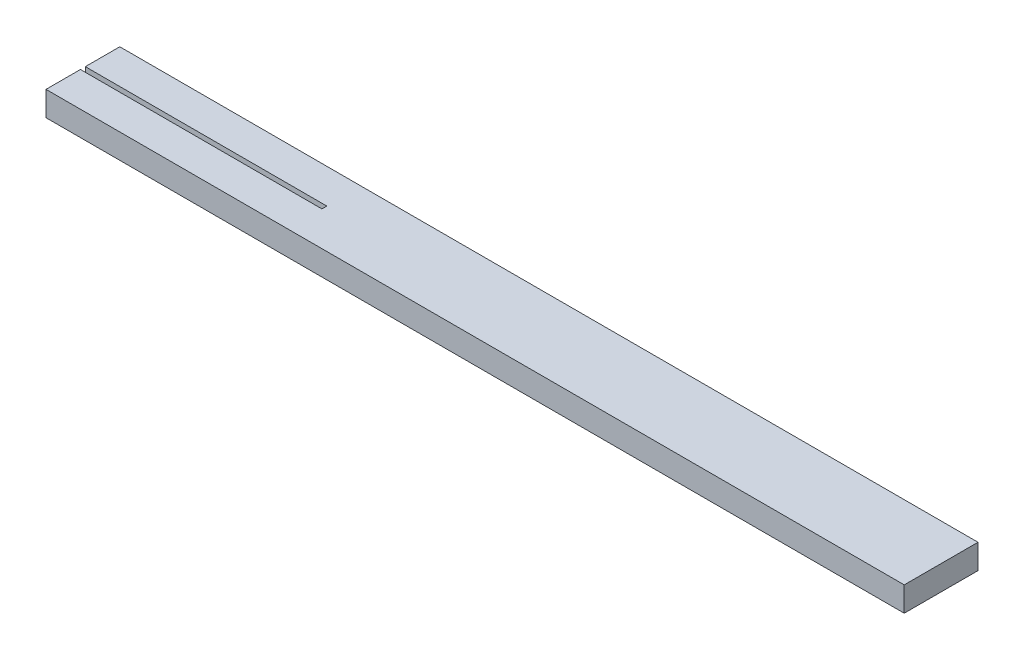
ISO-10303-21;
HEADER;
FILE_DESCRIPTION(('STEP AP214'),'2;1');
FILE_NAME('part.step','',(''),(''),'','','');
FILE_SCHEMA(('AUTOMOTIVE_DESIGN { 1 0 10303 214 1 1 1 1 }'));
ENDSEC;
DATA;
#1=APPLICATION_CONTEXT('core data for automotive mechanical design processes');
#2=APPLICATION_PROTOCOL_DEFINITION('international standard','automotive_design',2000,#1);
#3=PRODUCT_CONTEXT('',#1,'mechanical');
#4=PRODUCT('Part','Part','',(#3));
#5=PRODUCT_RELATED_PRODUCT_CATEGORY('part','',(#4));
#6=PRODUCT_DEFINITION_FORMATION('','',#4);
#7=PRODUCT_DEFINITION_CONTEXT('part definition',#1,'design');
#8=PRODUCT_DEFINITION('design','',#6,#7);
#9=PRODUCT_DEFINITION_SHAPE('','',#8);
#10=(LENGTH_UNIT() NAMED_UNIT(*) SI_UNIT(.MILLI.,.METRE.));
#11=(NAMED_UNIT(*) PLANE_ANGLE_UNIT() SI_UNIT($,.RADIAN.));
#12=(NAMED_UNIT(*) SI_UNIT($,.STERADIAN.) SOLID_ANGLE_UNIT());
#13=UNCERTAINTY_MEASURE_WITH_UNIT(LENGTH_MEASURE(1.E-05),#10,'distance_accuracy_value','');
#14=(GEOMETRIC_REPRESENTATION_CONTEXT(3) GLOBAL_UNCERTAINTY_ASSIGNED_CONTEXT((#13)) GLOBAL_UNIT_ASSIGNED_CONTEXT((#10,
#11,#12)) REPRESENTATION_CONTEXT('',''));
#15=CARTESIAN_POINT('',(0.,0.,0.));
#16=DIRECTION('',(0.,0.,1.));
#17=DIRECTION('',(1.,0.,0.));
#18=AXIS2_PLACEMENT_3D('',#15,#16,#17);
#19=CARTESIAN_POINT('',(-17.0392132961798,0.,-5.81303656597775));
#20=DIRECTION('',(0.,0.,1.));
#21=DIRECTION('',(1.,0.,0.));
#22=AXIS2_PLACEMENT_3D('',#19,#20,#21);
#23=PLANE('',#22);
#24=DIRECTION('',(1.,0.,0.));
#25=VECTOR('',#24,1.);
#26=CARTESIAN_POINT('',(-17.0392132961798,1.,-5.81303656597775));
#27=LINE('',#26,#25);
#28=CARTESIAN_POINT('',(-17.0392132961798,1.,-5.81303656597775));
#29=VERTEX_POINT('',#28);
#30=CARTESIAN_POINT('',(-7.21921329617973,1.,-5.81303656597775));
#31=VERTEX_POINT('',#30);
#32=EDGE_CURVE('E137',#29,#31,#27,.T.);
#33=ORIENTED_EDGE('',*,*,#32,.F.);
#34=DIRECTION('',(0.,1.,0.));
#35=VECTOR('',#34,1.);
#36=CARTESIAN_POINT('',(-17.0392132961798,0.,-5.81303656597775));
#37=LINE('',#36,#35);
#38=CARTESIAN_POINT('',(-17.0392132961798,0.,-5.81303656597775));
#39=VERTEX_POINT('',#38);
#40=EDGE_CURVE('E11',#39,#29,#37,.T.);
#41=ORIENTED_EDGE('',*,*,#40,.F.);
#42=DIRECTION('',(1.,0.,0.));
#43=VECTOR('',#42,1.);
#44=CARTESIAN_POINT('',(-17.0392132961798,0.,-5.81303656597775));
#45=LINE('',#44,#43);
#46=CARTESIAN_POINT('',(-7.21921329617973,0.,-5.81303656597775));
#47=VERTEX_POINT('',#46);
#48=EDGE_CURVE('E157',#39,#47,#45,.T.);
#49=ORIENTED_EDGE('',*,*,#48,.T.);
#50=DIRECTION('',(0.,1.,0.));
#51=VECTOR('',#50,1.);
#52=CARTESIAN_POINT('',(-7.21921329617973,0.,-5.81303656597775));
#53=LINE('',#52,#51);
#54=EDGE_CURVE('E43',#47,#31,#53,.T.);
#55=ORIENTED_EDGE('',*,*,#54,.T.);
#56=EDGE_LOOP('',(#33,#41,#49,#55));
#57=FACE_BOUND('',#56,.T.);
#58=ADVANCED_FACE('F40',(#57),#23,.T.);
#59=CARTESIAN_POINT('',(-17.0392132961798,0.,-7.21303656597775));
#60=DIRECTION('',(-1.,0.,0.));
#61=DIRECTION('',(0.,0.,1.));
#62=AXIS2_PLACEMENT_3D('',#59,#60,#61);
#63=PLANE('',#62);
#64=DIRECTION('',(0.,0.,1.));
#65=VECTOR('',#64,1.);
#66=CARTESIAN_POINT('',(-17.0392132961798,1.,-7.21303656597775));
#67=LINE('',#66,#65);
#68=CARTESIAN_POINT('',(-17.0392132961798,1.,-7.21303656597775));
#69=VERTEX_POINT('',#68);
#70=EDGE_CURVE('E155',#69,#29,#67,.T.);
#71=ORIENTED_EDGE('',*,*,#70,.F.);
#72=DIRECTION('',(0.,1.,0.));
#73=VECTOR('',#72,1.);
#74=CARTESIAN_POINT('',(-17.0392132961798,0.,-7.21303656597775));
#75=LINE('',#74,#73);
#76=CARTESIAN_POINT('',(-17.0392132961798,0.,-7.21303656597775));
#77=VERTEX_POINT('',#76);
#78=EDGE_CURVE('E49',#77,#69,#75,.T.);
#79=ORIENTED_EDGE('',*,*,#78,.F.);
#80=DIRECTION('',(0.,0.,1.));
#81=VECTOR('',#80,1.);
#82=CARTESIAN_POINT('',(-17.0392132961798,0.,-7.21303656597775));
#83=LINE('',#82,#81);
#84=EDGE_CURVE('E126',#77,#39,#83,.T.);
#85=ORIENTED_EDGE('',*,*,#84,.T.);
#86=ORIENTED_EDGE('',*,*,#40,.T.);
#87=EDGE_LOOP('',(#71,#79,#85,#86));
#88=FACE_BOUND('',#87,.T.);
#89=ADVANCED_FACE('F170',(#88),#63,.T.);
#90=CARTESIAN_POINT('',(-5.08921329617973,0.,-7.21303656597775));
#91=DIRECTION('',(0.,0.,-1.));
#92=DIRECTION('',(-1.,0.,0.));
#93=AXIS2_PLACEMENT_3D('',#90,#91,#92);
#94=PLANE('',#93);
#95=DIRECTION('',(-1.,0.,0.));
#96=VECTOR('',#95,1.);
#97=CARTESIAN_POINT('',(-5.08921329617973,1.,-7.21303656597775));
#98=LINE('',#97,#96);
#99=CARTESIAN_POINT('',(17.8607867038202,1.,-7.21303656597775));
#100=VERTEX_POINT('',#99);
#101=EDGE_CURVE('E113',#100,#69,#98,.T.);
#102=ORIENTED_EDGE('',*,*,#101,.F.);
#103=DIRECTION('',(0.,1.,0.));
#104=VECTOR('',#103,1.);
#105=CARTESIAN_POINT('',(17.8607867038202,0.,-7.21303656597775));
#106=LINE('',#105,#104);
#107=CARTESIAN_POINT('',(17.8607867038202,0.,-7.21303656597775));
#108=VERTEX_POINT('',#107);
#109=EDGE_CURVE('E109',#108,#100,#106,.T.);
#110=ORIENTED_EDGE('',*,*,#109,.F.);
#111=DIRECTION('',(-1.,0.,0.));
#112=VECTOR('',#111,1.);
#113=CARTESIAN_POINT('',(17.8607867038202,0.,-7.21303656597775));
#114=LINE('',#113,#112);
#115=EDGE_CURVE('E112',#108,#77,#114,.T.);
#116=ORIENTED_EDGE('',*,*,#115,.T.);
#117=ORIENTED_EDGE('',*,*,#78,.T.);
#118=EDGE_LOOP('',(#102,#110,#116,#117));
#119=FACE_BOUND('',#118,.T.);
#120=ADVANCED_FACE('F111',(#119),#94,.T.);
#121=CARTESIAN_POINT('',(17.8607867038202,0.,-4.21303656597775));
#122=DIRECTION('',(1.,0.,0.));
#123=DIRECTION('',(0.,0.,-1.));
#124=AXIS2_PLACEMENT_3D('',#121,#122,#123);
#125=PLANE('',#124);
#126=DIRECTION('',(0.,0.,-1.));
#127=VECTOR('',#126,1.);
#128=CARTESIAN_POINT('',(17.8607867038202,1.,-4.21303656597775));
#129=LINE('',#128,#127);
#130=CARTESIAN_POINT('',(17.8607867038202,1.,-4.21303656597775));
#131=VERTEX_POINT('',#130);
#132=EDGE_CURVE('E152',#131,#100,#129,.T.);
#133=ORIENTED_EDGE('',*,*,#132,.F.);
#134=DIRECTION('',(0.,1.,0.));
#135=VECTOR('',#134,1.);
#136=CARTESIAN_POINT('',(17.8607867038202,0.,-4.21303656597775));
#137=LINE('',#136,#135);
#138=CARTESIAN_POINT('',(17.8607867038202,0.,-4.21303656597775));
#139=VERTEX_POINT('',#138);
#140=EDGE_CURVE('E118',#139,#131,#137,.T.);
#141=ORIENTED_EDGE('',*,*,#140,.F.);
#142=DIRECTION('',(0.,0.,-1.));
#143=VECTOR('',#142,1.);
#144=CARTESIAN_POINT('',(17.8607867038202,0.,-4.21303656597775));
#145=LINE('',#144,#143);
#146=EDGE_CURVE('E125',#139,#108,#145,.T.);
#147=ORIENTED_EDGE('',*,*,#146,.T.);
#148=ORIENTED_EDGE('',*,*,#109,.T.);
#149=EDGE_LOOP('',(#133,#141,#147,#148));
#150=FACE_BOUND('',#149,.T.);
#151=ADVANCED_FACE('F129',(#150),#125,.T.);
#152=CARTESIAN_POINT('',(-2.85368948460446,0.,-4.21303656597775));
#153=DIRECTION('',(0.,0.,1.));
#154=DIRECTION('',(1.,0.,0.));
#155=AXIS2_PLACEMENT_3D('',#152,#153,#154);
#156=PLANE('',#155);
#157=DIRECTION('',(1.,0.,0.));
#158=VECTOR('',#157,1.);
#159=CARTESIAN_POINT('',(-2.85368948460446,1.,-4.21303656597775));
#160=LINE('',#159,#158);
#161=CARTESIAN_POINT('',(-17.0392132961798,1.,-4.21303656597775));
#162=VERTEX_POINT('',#161);
#163=EDGE_CURVE('E149',#162,#131,#160,.T.);
#164=ORIENTED_EDGE('',*,*,#163,.F.);
#165=DIRECTION('',(0.,1.,0.));
#166=VECTOR('',#165,1.);
#167=CARTESIAN_POINT('',(-17.0392132961798,0.,-4.21303656597775));
#168=LINE('',#167,#166);
#169=CARTESIAN_POINT('',(-17.0392132961798,0.,-4.21303656597775));
#170=VERTEX_POINT('',#169);
#171=EDGE_CURVE('E161',#170,#162,#168,.T.);
#172=ORIENTED_EDGE('',*,*,#171,.F.);
#173=DIRECTION('',(1.,0.,0.));
#174=VECTOR('',#173,1.);
#175=CARTESIAN_POINT('',(-17.0392132961798,0.,-4.21303656597775));
#176=LINE('',#175,#174);
#177=EDGE_CURVE('E130',#170,#139,#176,.T.);
#178=ORIENTED_EDGE('',*,*,#177,.T.);
#179=ORIENTED_EDGE('',*,*,#140,.T.);
#180=EDGE_LOOP('',(#164,#172,#178,#179));
#181=FACE_BOUND('',#180,.T.);
#182=ADVANCED_FACE('F183',(#181),#156,.T.);
#183=CARTESIAN_POINT('',(-17.0392132961798,0.,-5.61303656597775));
#184=DIRECTION('',(-1.,0.,0.));
#185=DIRECTION('',(0.,0.,1.));
#186=AXIS2_PLACEMENT_3D('',#183,#184,#185);
#187=PLANE('',#186);
#188=DIRECTION('',(0.,0.,1.));
#189=VECTOR('',#188,1.);
#190=CARTESIAN_POINT('',(-17.0392132961798,1.,-5.61303656597775));
#191=LINE('',#190,#189);
#192=CARTESIAN_POINT('',(-17.0392132961798,1.,-5.61303656597775));
#193=VERTEX_POINT('',#192);
#194=EDGE_CURVE('E146',#193,#162,#191,.T.);
#195=ORIENTED_EDGE('',*,*,#194,.F.);
#196=DIRECTION('',(0.,1.,0.));
#197=VECTOR('',#196,1.);
#198=CARTESIAN_POINT('',(-17.0392132961798,0.,-5.61303656597775));
#199=LINE('',#198,#197);
#200=CARTESIAN_POINT('',(-17.0392132961798,0.,-5.61303656597775));
#201=VERTEX_POINT('',#200);
#202=EDGE_CURVE('E164',#201,#193,#199,.T.);
#203=ORIENTED_EDGE('',*,*,#202,.F.);
#204=DIRECTION('',(0.,0.,1.));
#205=VECTOR('',#204,1.);
#206=CARTESIAN_POINT('',(-17.0392132961798,0.,-5.61303656597775));
#207=LINE('',#206,#205);
#208=EDGE_CURVE('E132',#201,#170,#207,.T.);
#209=ORIENTED_EDGE('',*,*,#208,.T.);
#210=ORIENTED_EDGE('',*,*,#171,.T.);
#211=EDGE_LOOP('',(#195,#203,#209,#210));
#212=FACE_BOUND('',#211,.T.);
#213=ADVANCED_FACE('F186',(#212),#187,.T.);
#214=CARTESIAN_POINT('',(-7.21921329617973,0.,-5.61303656597775));
#215=DIRECTION('',(0.,0.,-1.));
#216=DIRECTION('',(-1.,0.,0.));
#217=AXIS2_PLACEMENT_3D('',#214,#215,#216);
#218=PLANE('',#217);
#219=DIRECTION('',(-1.,0.,0.));
#220=VECTOR('',#219,1.);
#221=CARTESIAN_POINT('',(-7.21921329617973,1.,-5.61303656597775));
#222=LINE('',#221,#220);
#223=CARTESIAN_POINT('',(-7.21921329617973,1.,-5.61303656597775));
#224=VERTEX_POINT('',#223);
#225=EDGE_CURVE('E143',#224,#193,#222,.T.);
#226=ORIENTED_EDGE('',*,*,#225,.F.);
#227=DIRECTION('',(0.,1.,0.));
#228=VECTOR('',#227,1.);
#229=CARTESIAN_POINT('',(-7.21921329617973,0.,-5.61303656597775));
#230=LINE('',#229,#228);
#231=CARTESIAN_POINT('',(-7.21921329617973,0.,-5.61303656597775));
#232=VERTEX_POINT('',#231);
#233=EDGE_CURVE('E165',#232,#224,#230,.T.);
#234=ORIENTED_EDGE('',*,*,#233,.F.);
#235=DIRECTION('',(-1.,0.,0.));
#236=VECTOR('',#235,1.);
#237=CARTESIAN_POINT('',(-7.21921329617973,0.,-5.61303656597775));
#238=LINE('',#237,#236);
#239=EDGE_CURVE('E272',#232,#201,#238,.T.);
#240=ORIENTED_EDGE('',*,*,#239,.T.);
#241=ORIENTED_EDGE('',*,*,#202,.T.);
#242=EDGE_LOOP('',(#226,#234,#240,#241));
#243=FACE_BOUND('',#242,.T.);
#244=ADVANCED_FACE('F190',(#243),#218,.T.);
#245=CARTESIAN_POINT('',(-7.21921329617973,0.,-5.81303656597775));
#246=DIRECTION('',(-1.,0.,0.));
#247=DIRECTION('',(0.,0.,1.));
#248=AXIS2_PLACEMENT_3D('',#245,#246,#247);
#249=PLANE('',#248);
#250=DIRECTION('',(0.,0.,1.));
#251=VECTOR('',#250,1.);
#252=CARTESIAN_POINT('',(-7.21921329617973,1.,-5.81303656597775));
#253=LINE('',#252,#251);
#254=EDGE_CURVE('E140',#31,#224,#253,.T.);
#255=ORIENTED_EDGE('',*,*,#254,.F.);
#256=ORIENTED_EDGE('',*,*,#54,.F.);
#257=DIRECTION('',(0.,0.,1.));
#258=VECTOR('',#257,1.);
#259=CARTESIAN_POINT('',(-7.21921329617973,0.,-5.81303656597775));
#260=LINE('',#259,#258);
#261=EDGE_CURVE('E273',#47,#232,#260,.T.);
#262=ORIENTED_EDGE('',*,*,#261,.T.);
#263=ORIENTED_EDGE('',*,*,#233,.T.);
#264=EDGE_LOOP('',(#255,#256,#262,#263));
#265=FACE_BOUND('',#264,.T.);
#266=ADVANCED_FACE('F167',(#265),#249,.T.);
#267=CARTESIAN_POINT('',(0.,0.,0.));
#268=DIRECTION('',(0.,-1.,0.));
#269=DIRECTION('',(0.,0.,-1.));
#270=AXIS2_PLACEMENT_3D('',#267,#268,#269);
#271=PLANE('',#270);
#272=ORIENTED_EDGE('',*,*,#48,.F.);
#273=ORIENTED_EDGE('',*,*,#84,.F.);
#274=ORIENTED_EDGE('',*,*,#115,.F.);
#275=ORIENTED_EDGE('',*,*,#146,.F.);
#276=ORIENTED_EDGE('',*,*,#177,.F.);
#277=ORIENTED_EDGE('',*,*,#208,.F.);
#278=ORIENTED_EDGE('',*,*,#239,.F.);
#279=ORIENTED_EDGE('',*,*,#261,.F.);
#280=EDGE_LOOP('',(#272,#273,#274,#275,#276,#277,#278,#279));
#281=FACE_BOUND('',#280,.T.);
#282=ADVANCED_FACE('F123',(#281),#271,.T.);
#283=CARTESIAN_POINT('',(0.,1.,0.));
#284=DIRECTION('',(0.,-1.,0.));
#285=DIRECTION('',(0.,0.,-1.));
#286=AXIS2_PLACEMENT_3D('',#283,#284,#285);
#287=PLANE('',#286);
#288=ORIENTED_EDGE('',*,*,#32,.T.);
#289=ORIENTED_EDGE('',*,*,#254,.T.);
#290=ORIENTED_EDGE('',*,*,#225,.T.);
#291=ORIENTED_EDGE('',*,*,#194,.T.);
#292=ORIENTED_EDGE('',*,*,#163,.T.);
#293=ORIENTED_EDGE('',*,*,#132,.T.);
#294=ORIENTED_EDGE('',*,*,#101,.T.);
#295=ORIENTED_EDGE('',*,*,#70,.T.);
#296=EDGE_LOOP('',(#288,#289,#290,#291,#292,#293,#294,#295));
#297=FACE_BOUND('',#296,.T.);
#298=ADVANCED_FACE('F169',(#297),#287,.F.);
#299=CLOSED_SHELL('',(#58,#89,#120,#151,#182,#213,#244,#266,#282,#298));
#300=MANIFOLD_SOLID_BREP('B2',#299);
#301=ADVANCED_BREP_SHAPE_REPRESENTATION('',(#18,#300),#14);
#302=SHAPE_DEFINITION_REPRESENTATION(#9,#301);
ENDSEC;
END-ISO-10303-21;
